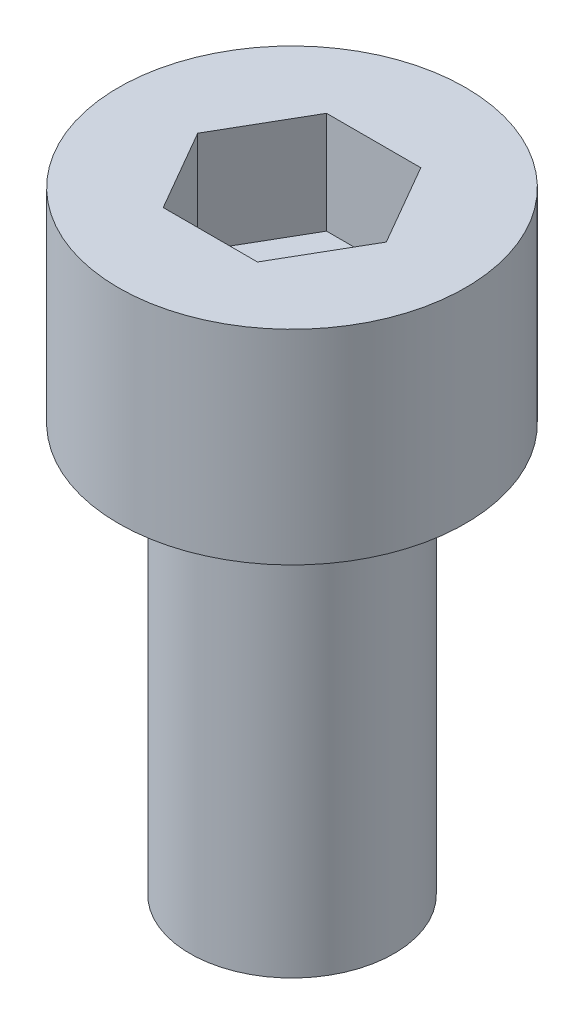
ISO-10303-21;
HEADER;
FILE_DESCRIPTION(('STEP AP214'),'2;1');
FILE_NAME('part.step','',(''),(''),'','','');
FILE_SCHEMA(('AUTOMOTIVE_DESIGN { 1 0 10303 214 1 1 1 1 }'));
ENDSEC;
DATA;
#1=APPLICATION_CONTEXT('core data for automotive mechanical design processes');
#2=APPLICATION_PROTOCOL_DEFINITION('international standard','automotive_design',2000,#1);
#3=PRODUCT_CONTEXT('',#1,'mechanical');
#4=PRODUCT('Part','Part','',(#3));
#5=PRODUCT_RELATED_PRODUCT_CATEGORY('part','',(#4));
#6=PRODUCT_DEFINITION_FORMATION('','',#4);
#7=PRODUCT_DEFINITION_CONTEXT('part definition',#1,'design');
#8=PRODUCT_DEFINITION('design','',#6,#7);
#9=PRODUCT_DEFINITION_SHAPE('','',#8);
#10=(LENGTH_UNIT() NAMED_UNIT(*) SI_UNIT(.MILLI.,.METRE.));
#11=(NAMED_UNIT(*) PLANE_ANGLE_UNIT() SI_UNIT($,.RADIAN.));
#12=(NAMED_UNIT(*) SI_UNIT($,.STERADIAN.) SOLID_ANGLE_UNIT());
#13=UNCERTAINTY_MEASURE_WITH_UNIT(LENGTH_MEASURE(1.E-05),#10,'distance_accuracy_value','');
#14=(GEOMETRIC_REPRESENTATION_CONTEXT(3) GLOBAL_UNCERTAINTY_ASSIGNED_CONTEXT((#13)) GLOBAL_UNIT_ASSIGNED_CONTEXT((#10,
#11,#12)) REPRESENTATION_CONTEXT('',''));
#15=CARTESIAN_POINT('',(0.,0.,0.));
#16=DIRECTION('',(0.,0.,1.));
#17=DIRECTION('',(1.,0.,0.));
#18=AXIS2_PLACEMENT_3D('',#15,#16,#17);
#19=CARTESIAN_POINT('',(0.,5.,0.));
#20=DIRECTION('',(0.,-1.,0.));
#21=DIRECTION('',(0.,0.,-1.));
#22=AXIS2_PLACEMENT_3D('',#19,#20,#21);
#23=CYLINDRICAL_SURFACE('',#22,4.25);
#24=CARTESIAN_POINT('',(0.,5.,0.));
#25=DIRECTION('',(0.,1.,0.));
#26=DIRECTION('',(0.,0.,1.));
#27=AXIS2_PLACEMENT_3D('',#24,#25,#26);
#28=CIRCLE('',#27,4.25);
#29=CARTESIAN_POINT('',(0.,5.,4.25));
#30=VERTEX_POINT('',#29);
#31=EDGE_CURVE('E43',#30,#30,#28,.T.);
#32=ORIENTED_EDGE('',*,*,#31,.F.);
#33=EDGE_LOOP('',(#32));
#34=FACE_BOUND('',#33,.T.);
#35=CARTESIAN_POINT('',(0.,0.,0.));
#36=DIRECTION('',(0.,1.,0.));
#37=DIRECTION('',(0.,0.,1.));
#38=AXIS2_PLACEMENT_3D('',#35,#36,#37);
#39=CIRCLE('',#38,4.25);
#40=CARTESIAN_POINT('',(0.,0.,4.25));
#41=VERTEX_POINT('',#40);
#42=EDGE_CURVE('E38',#41,#41,#39,.T.);
#43=ORIENTED_EDGE('',*,*,#42,.T.);
#44=EDGE_LOOP('',(#43));
#45=FACE_BOUND('',#44,.T.);
#46=ADVANCED_FACE('F35',(#34,#45),#23,.T.);
#47=CARTESIAN_POINT('',(0.,5.,0.));
#48=DIRECTION('',(0.,1.,0.));
#49=DIRECTION('',(0.,0.,1.));
#50=AXIS2_PLACEMENT_3D('',#47,#48,#49);
#51=PLANE('',#50);
#52=DIRECTION('',(0.5,0.,-0.866025403784439));
#53=VECTOR('',#52,1.);
#54=CARTESIAN_POINT('',(1.15470053837925,5.,2.));
#55=LINE('',#54,#53);
#56=CARTESIAN_POINT('',(1.15470053837925,5.,2.));
#57=VERTEX_POINT('',#56);
#58=CARTESIAN_POINT('',(2.3094010767585,5.,0.));
#59=VERTEX_POINT('',#58);
#60=EDGE_CURVE('E51',#57,#59,#55,.T.);
#61=ORIENTED_EDGE('',*,*,#60,.F.);
#62=DIRECTION('',(1.,0.,0.));
#63=VECTOR('',#62,1.);
#64=CARTESIAN_POINT('',(-1.15470053837925,5.,2.));
#65=LINE('',#64,#63);
#66=CARTESIAN_POINT('',(-1.15470053837925,5.,2.));
#67=VERTEX_POINT('',#66);
#68=EDGE_CURVE('E135',#67,#57,#65,.T.);
#69=ORIENTED_EDGE('',*,*,#68,.F.);
#70=DIRECTION('',(0.5,0.,0.866025403784438));
#71=VECTOR('',#70,1.);
#72=CARTESIAN_POINT('',(-2.3094010767585,5.,0.));
#73=LINE('',#72,#71);
#74=CARTESIAN_POINT('',(-2.3094010767585,5.,0.));
#75=VERTEX_POINT('',#74);
#76=EDGE_CURVE('E133',#75,#67,#73,.T.);
#77=ORIENTED_EDGE('',*,*,#76,.F.);
#78=DIRECTION('',(-0.5,0.,0.866025403784439));
#79=VECTOR('',#78,1.);
#80=CARTESIAN_POINT('',(-1.15470053837925,5.,-2.));
#81=LINE('',#80,#79);
#82=CARTESIAN_POINT('',(-1.15470053837925,5.,-2.));
#83=VERTEX_POINT('',#82);
#84=EDGE_CURVE('E99',#83,#75,#81,.T.);
#85=ORIENTED_EDGE('',*,*,#84,.F.);
#86=DIRECTION('',(-1.,0.,0.));
#87=VECTOR('',#86,1.);
#88=CARTESIAN_POINT('',(1.15470053837925,5.,-2.));
#89=LINE('',#88,#87);
#90=CARTESIAN_POINT('',(1.15470053837925,5.,-2.));
#91=VERTEX_POINT('',#90);
#92=EDGE_CURVE('E129',#91,#83,#89,.T.);
#93=ORIENTED_EDGE('',*,*,#92,.F.);
#94=DIRECTION('',(-0.5,0.,-0.866025403784438));
#95=VECTOR('',#94,1.);
#96=CARTESIAN_POINT('',(2.3094010767585,5.,0.));
#97=LINE('',#96,#95);
#98=EDGE_CURVE('E125',#59,#91,#97,.T.);
#99=ORIENTED_EDGE('',*,*,#98,.F.);
#100=EDGE_LOOP('',(#61,#69,#77,#85,#93,#99));
#101=FACE_BOUND('',#100,.T.);
#102=ORIENTED_EDGE('',*,*,#31,.T.);
#103=EDGE_LOOP('',(#102));
#104=FACE_BOUND('',#103,.T.);
#105=ADVANCED_FACE('F153',(#101,#104),#51,.T.);
#106=CARTESIAN_POINT('',(0.,0.,0.));
#107=DIRECTION('',(0.,1.,0.));
#108=DIRECTION('',(0.,0.,1.));
#109=AXIS2_PLACEMENT_3D('',#106,#107,#108);
#110=PLANE('',#109);
#111=CARTESIAN_POINT('',(0.,0.,0.));
#112=DIRECTION('',(0.,-1.,0.));
#113=DIRECTION('',(0.,0.,-1.));
#114=AXIS2_PLACEMENT_3D('',#111,#112,#113);
#115=CIRCLE('',#114,2.5);
#116=CARTESIAN_POINT('',(0.,0.,-2.5));
#117=VERTEX_POINT('',#116);
#118=EDGE_CURVE('E11',#117,#117,#115,.T.);
#119=ORIENTED_EDGE('',*,*,#118,.F.);
#120=EDGE_LOOP('',(#119));
#121=FACE_BOUND('',#120,.T.);
#122=ORIENTED_EDGE('',*,*,#42,.F.);
#123=EDGE_LOOP('',(#122));
#124=FACE_BOUND('',#123,.T.);
#125=ADVANCED_FACE('F150',(#121,#124),#110,.F.);
#126=CARTESIAN_POINT('',(1.15470053837925,2.5,2.));
#127=DIRECTION('',(0.866025403784439,0.,0.5));
#128=DIRECTION('',(0.5,0.,-0.866025403784439));
#129=AXIS2_PLACEMENT_3D('',#126,#127,#128);
#130=PLANE('',#129);
#131=ORIENTED_EDGE('',*,*,#60,.T.);
#132=DIRECTION('',(0.,1.,0.));
#133=VECTOR('',#132,1.);
#134=CARTESIAN_POINT('',(2.3094010767585,2.5,0.));
#135=LINE('',#134,#133);
#136=CARTESIAN_POINT('',(2.3094010767585,2.5,0.));
#137=VERTEX_POINT('',#136);
#138=EDGE_CURVE('E81',#137,#59,#135,.T.);
#139=ORIENTED_EDGE('',*,*,#138,.F.);
#140=DIRECTION('',(0.5,0.,-0.866025403784439));
#141=VECTOR('',#140,1.);
#142=CARTESIAN_POINT('',(1.15470053837925,2.5,2.));
#143=LINE('',#142,#141);
#144=CARTESIAN_POINT('',(1.15470053837925,2.5,2.));
#145=VERTEX_POINT('',#144);
#146=EDGE_CURVE('E137',#145,#137,#143,.T.);
#147=ORIENTED_EDGE('',*,*,#146,.F.);
#148=DIRECTION('',(0.,1.,0.));
#149=VECTOR('',#148,1.);
#150=CARTESIAN_POINT('',(1.15470053837925,2.5,2.));
#151=LINE('',#150,#149);
#152=EDGE_CURVE('E59',#145,#57,#151,.T.);
#153=ORIENTED_EDGE('',*,*,#152,.T.);
#154=EDGE_LOOP('',(#131,#139,#147,#153));
#155=FACE_BOUND('',#154,.T.);
#156=ADVANCED_FACE('F152',(#155),#130,.F.);
#157=CARTESIAN_POINT('',(-1.15470053837925,2.5,2.));
#158=DIRECTION('',(0.,0.,1.));
#159=DIRECTION('',(1.,0.,0.));
#160=AXIS2_PLACEMENT_3D('',#157,#158,#159);
#161=PLANE('',#160);
#162=ORIENTED_EDGE('',*,*,#68,.T.);
#163=ORIENTED_EDGE('',*,*,#152,.F.);
#164=DIRECTION('',(1.,0.,0.));
#165=VECTOR('',#164,1.);
#166=CARTESIAN_POINT('',(-1.15470053837925,2.5,2.));
#167=LINE('',#166,#165);
#168=CARTESIAN_POINT('',(-1.15470053837925,2.5,2.));
#169=VERTEX_POINT('',#168);
#170=EDGE_CURVE('E111',#169,#145,#167,.T.);
#171=ORIENTED_EDGE('',*,*,#170,.F.);
#172=DIRECTION('',(0.,1.,0.));
#173=VECTOR('',#172,1.);
#174=CARTESIAN_POINT('',(-1.15470053837925,2.5,2.));
#175=LINE('',#174,#173);
#176=EDGE_CURVE('E103',#169,#67,#175,.T.);
#177=ORIENTED_EDGE('',*,*,#176,.T.);
#178=EDGE_LOOP('',(#162,#163,#171,#177));
#179=FACE_BOUND('',#178,.T.);
#180=ADVANCED_FACE('F159',(#179),#161,.F.);
#181=CARTESIAN_POINT('',(-2.3094010767585,2.5,0.));
#182=DIRECTION('',(-0.866025403784439,0.,0.5));
#183=DIRECTION('',(0.5,0.,0.866025403784439));
#184=AXIS2_PLACEMENT_3D('',#181,#182,#183);
#185=PLANE('',#184);
#186=ORIENTED_EDGE('',*,*,#76,.T.);
#187=ORIENTED_EDGE('',*,*,#176,.F.);
#188=DIRECTION('',(0.5,0.,0.866025403784438));
#189=VECTOR('',#188,1.);
#190=CARTESIAN_POINT('',(-2.3094010767585,2.5,0.));
#191=LINE('',#190,#189);
#192=CARTESIAN_POINT('',(-2.3094010767585,2.5,0.));
#193=VERTEX_POINT('',#192);
#194=EDGE_CURVE('E107',#193,#169,#191,.T.);
#195=ORIENTED_EDGE('',*,*,#194,.F.);
#196=DIRECTION('',(0.,1.,0.));
#197=VECTOR('',#196,1.);
#198=CARTESIAN_POINT('',(-2.3094010767585,2.5,0.));
#199=LINE('',#198,#197);
#200=EDGE_CURVE('E92',#193,#75,#199,.T.);
#201=ORIENTED_EDGE('',*,*,#200,.T.);
#202=EDGE_LOOP('',(#186,#187,#195,#201));
#203=FACE_BOUND('',#202,.T.);
#204=ADVANCED_FACE('F108',(#203),#185,.F.);
#205=CARTESIAN_POINT('',(-1.15470053837925,2.5,-2.));
#206=DIRECTION('',(-0.866025403784439,0.,-0.5));
#207=DIRECTION('',(-0.5,0.,0.866025403784439));
#208=AXIS2_PLACEMENT_3D('',#205,#206,#207);
#209=PLANE('',#208);
#210=ORIENTED_EDGE('',*,*,#84,.T.);
#211=ORIENTED_EDGE('',*,*,#200,.F.);
#212=DIRECTION('',(-0.5,0.,0.866025403784439));
#213=VECTOR('',#212,1.);
#214=CARTESIAN_POINT('',(-1.15470053837925,2.5,-2.));
#215=LINE('',#214,#213);
#216=CARTESIAN_POINT('',(-1.15470053837925,2.5,-2.));
#217=VERTEX_POINT('',#216);
#218=EDGE_CURVE('E96',#217,#193,#215,.T.);
#219=ORIENTED_EDGE('',*,*,#218,.F.);
#220=DIRECTION('',(0.,1.,0.));
#221=VECTOR('',#220,1.);
#222=CARTESIAN_POINT('',(-1.15470053837925,2.5,-2.));
#223=LINE('',#222,#221);
#224=EDGE_CURVE('E104',#217,#83,#223,.T.);
#225=ORIENTED_EDGE('',*,*,#224,.T.);
#226=EDGE_LOOP('',(#210,#211,#219,#225));
#227=FACE_BOUND('',#226,.T.);
#228=ADVANCED_FACE('F94',(#227),#209,.F.);
#229=CARTESIAN_POINT('',(1.15470053837925,2.5,-2.));
#230=DIRECTION('',(0.,0.,-1.));
#231=DIRECTION('',(-1.,0.,0.));
#232=AXIS2_PLACEMENT_3D('',#229,#230,#231);
#233=PLANE('',#232);
#234=ORIENTED_EDGE('',*,*,#92,.T.);
#235=ORIENTED_EDGE('',*,*,#224,.F.);
#236=DIRECTION('',(-1.,0.,0.));
#237=VECTOR('',#236,1.);
#238=CARTESIAN_POINT('',(1.15470053837925,2.5,-2.));
#239=LINE('',#238,#237);
#240=CARTESIAN_POINT('',(1.15470053837925,2.5,-2.));
#241=VERTEX_POINT('',#240);
#242=EDGE_CURVE('E117',#241,#217,#239,.T.);
#243=ORIENTED_EDGE('',*,*,#242,.F.);
#244=DIRECTION('',(0.,1.,0.));
#245=VECTOR('',#244,1.);
#246=CARTESIAN_POINT('',(1.15470053837925,2.5,-2.));
#247=LINE('',#246,#245);
#248=EDGE_CURVE('E141',#241,#91,#247,.T.);
#249=ORIENTED_EDGE('',*,*,#248,.T.);
#250=EDGE_LOOP('',(#234,#235,#243,#249));
#251=FACE_BOUND('',#250,.T.);
#252=ADVANCED_FACE('F204',(#251),#233,.F.);
#253=CARTESIAN_POINT('',(2.3094010767585,2.5,0.));
#254=DIRECTION('',(0.866025403784438,0.,-0.5));
#255=DIRECTION('',(-0.5,0.,-0.866025403784439));
#256=AXIS2_PLACEMENT_3D('',#253,#254,#255);
#257=PLANE('',#256);
#258=ORIENTED_EDGE('',*,*,#98,.T.);
#259=ORIENTED_EDGE('',*,*,#248,.F.);
#260=DIRECTION('',(-0.5,0.,-0.866025403784438));
#261=VECTOR('',#260,1.);
#262=CARTESIAN_POINT('',(2.3094010767585,2.5,0.));
#263=LINE('',#262,#261);
#264=EDGE_CURVE('E119',#137,#241,#263,.T.);
#265=ORIENTED_EDGE('',*,*,#264,.F.);
#266=ORIENTED_EDGE('',*,*,#138,.T.);
#267=EDGE_LOOP('',(#258,#259,#265,#266));
#268=FACE_BOUND('',#267,.T.);
#269=ADVANCED_FACE('F213',(#268),#257,.F.);
#270=CARTESIAN_POINT('',(0.,2.5,0.));
#271=DIRECTION('',(0.,1.,0.));
#272=DIRECTION('',(0.,0.,1.));
#273=AXIS2_PLACEMENT_3D('',#270,#271,#272);
#274=PLANE('',#273);
#275=ORIENTED_EDGE('',*,*,#146,.T.);
#276=ORIENTED_EDGE('',*,*,#264,.T.);
#277=ORIENTED_EDGE('',*,*,#242,.T.);
#278=ORIENTED_EDGE('',*,*,#218,.T.);
#279=ORIENTED_EDGE('',*,*,#194,.T.);
#280=ORIENTED_EDGE('',*,*,#170,.T.);
#281=EDGE_LOOP('',(#275,#276,#277,#278,#279,#280));
#282=FACE_BOUND('',#281,.T.);
#283=ADVANCED_FACE('F114',(#282),#274,.T.);
#284=CARTESIAN_POINT('',(0.,-10.,0.));
#285=DIRECTION('',(0.,1.,0.));
#286=DIRECTION('',(0.,0.,1.));
#287=AXIS2_PLACEMENT_3D('',#284,#285,#286);
#288=CYLINDRICAL_SURFACE('',#287,2.5);
#289=CARTESIAN_POINT('',(0.,-10.,0.));
#290=DIRECTION('',(0.,-1.,0.));
#291=DIRECTION('',(0.,0.,-1.));
#292=AXIS2_PLACEMENT_3D('',#289,#290,#291);
#293=CIRCLE('',#292,2.5);
#294=CARTESIAN_POINT('',(0.,-10.,-2.5));
#295=VERTEX_POINT('',#294);
#296=EDGE_CURVE('E126',#295,#295,#293,.T.);
#297=ORIENTED_EDGE('',*,*,#296,.F.);
#298=EDGE_LOOP('',(#297));
#299=FACE_BOUND('',#298,.T.);
#300=ORIENTED_EDGE('',*,*,#118,.T.);
#301=EDGE_LOOP('',(#300));
#302=FACE_BOUND('',#301,.T.);
#303=ADVANCED_FACE('F231',(#299,#302),#288,.T.);
#304=CARTESIAN_POINT('',(0.,-10.,0.));
#305=DIRECTION('',(0.,-1.,0.));
#306=DIRECTION('',(0.,0.,-1.));
#307=AXIS2_PLACEMENT_3D('',#304,#305,#306);
#308=PLANE('',#307);
#309=ORIENTED_EDGE('',*,*,#296,.T.);
#310=EDGE_LOOP('',(#309));
#311=FACE_BOUND('',#310,.T.);
#312=ADVANCED_FACE('F244',(#311),#308,.T.);
#313=CLOSED_SHELL('',(#46,#105,#125,#156,#180,#204,#228,#252,#269,#283,#303,#312));
#314=MANIFOLD_SOLID_BREP('B2',#313);
#315=ADVANCED_BREP_SHAPE_REPRESENTATION('',(#18,#314),#14);
#316=SHAPE_DEFINITION_REPRESENTATION(#9,#315);
ENDSEC;
END-ISO-10303-21;
